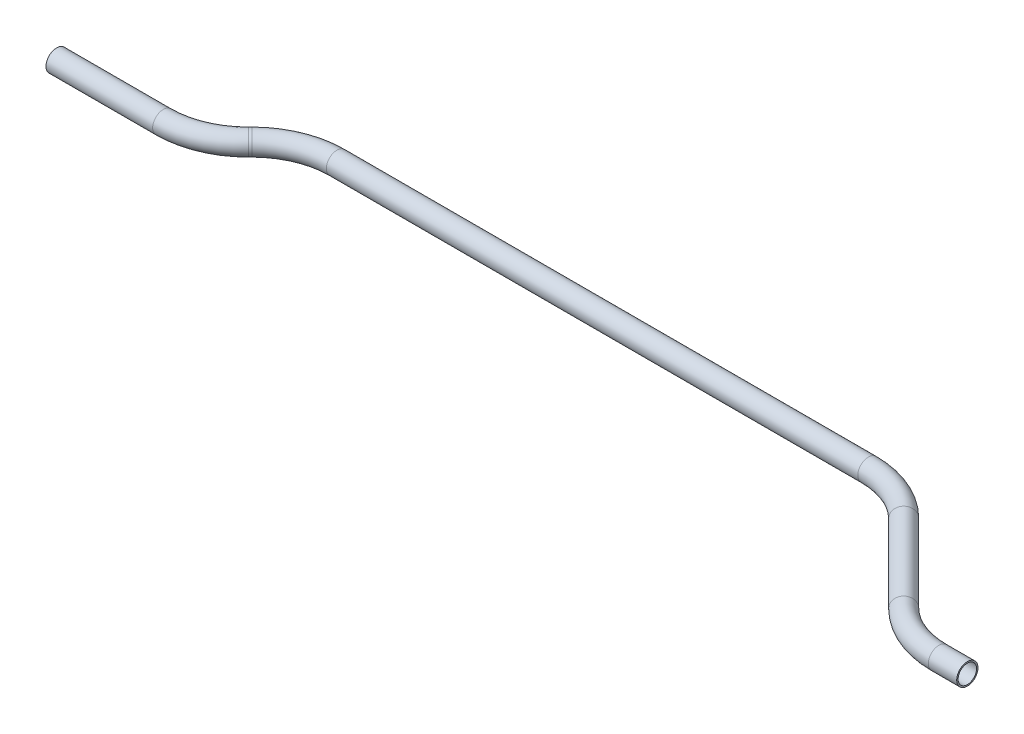
ISO-10303-21;
HEADER;
FILE_DESCRIPTION(('STEP AP214'),'2;1');
FILE_NAME('part.step','',(''),(''),'','','');
FILE_SCHEMA(('AUTOMOTIVE_DESIGN { 1 0 10303 214 1 1 1 1 }'));
ENDSEC;
DATA;
#1=APPLICATION_CONTEXT('core data for automotive mechanical design processes');
#2=APPLICATION_PROTOCOL_DEFINITION('international standard','automotive_design',2000,#1);
#3=PRODUCT_CONTEXT('',#1,'mechanical');
#4=PRODUCT('Part','Part','',(#3));
#5=PRODUCT_RELATED_PRODUCT_CATEGORY('part','',(#4));
#6=PRODUCT_DEFINITION_FORMATION('','',#4);
#7=PRODUCT_DEFINITION_CONTEXT('part definition',#1,'design');
#8=PRODUCT_DEFINITION('design','',#6,#7);
#9=PRODUCT_DEFINITION_SHAPE('','',#8);
#10=(LENGTH_UNIT() NAMED_UNIT(*) SI_UNIT(.MILLI.,.METRE.));
#11=(NAMED_UNIT(*) PLANE_ANGLE_UNIT() SI_UNIT($,.RADIAN.));
#12=(NAMED_UNIT(*) SI_UNIT($,.STERADIAN.) SOLID_ANGLE_UNIT());
#13=UNCERTAINTY_MEASURE_WITH_UNIT(LENGTH_MEASURE(1.E-05),#10,'distance_accuracy_value','');
#14=(GEOMETRIC_REPRESENTATION_CONTEXT(3) GLOBAL_UNCERTAINTY_ASSIGNED_CONTEXT((#13)) GLOBAL_UNIT_ASSIGNED_CONTEXT((#10,
#11,#12)) REPRESENTATION_CONTEXT('',''));
#15=CARTESIAN_POINT('',(0.,0.,0.));
#16=DIRECTION('',(0.,0.,1.));
#17=DIRECTION('',(1.,0.,0.));
#18=AXIS2_PLACEMENT_3D('',#15,#16,#17);
#19=CARTESIAN_POINT('',(0.,0.,0.));
#20=DIRECTION('',(1.,0.,0.));
#21=DIRECTION('',(0.,0.,-1.));
#22=AXIS2_PLACEMENT_3D('',#19,#20,#21);
#23=CYLINDRICAL_SURFACE('',#22,9.525);
#24=CARTESIAN_POINT('',(95.4369265471701,0.,0.));
#25=DIRECTION('',(1.,0.,0.));
#26=DIRECTION('',(0.,0.,-1.));
#27=AXIS2_PLACEMENT_3D('',#24,#25,#26);
#28=CIRCLE('',#27,9.525);
#29=CARTESIAN_POINT('',(95.4369265471701,0.,9.52499999999995));
#30=VERTEX_POINT('',#29);
#31=EDGE_CURVE('E59',#30,#30,#28,.T.);
#32=ORIENTED_EDGE('',*,*,#31,.F.);
#33=EDGE_LOOP('',(#32));
#34=FACE_BOUND('',#33,.T.);
#35=CARTESIAN_POINT('',(0.,0.,0.));
#36=DIRECTION('',(1.,0.,0.));
#37=DIRECTION('',(0.,0.,-1.));
#38=AXIS2_PLACEMENT_3D('',#35,#36,#37);
#39=CIRCLE('',#38,9.525);
#40=CARTESIAN_POINT('',(0.,0.,-9.525));
#41=VERTEX_POINT('',#40);
#42=EDGE_CURVE('E56',#41,#41,#39,.T.);
#43=ORIENTED_EDGE('',*,*,#42,.T.);
#44=EDGE_LOOP('',(#43));
#45=FACE_BOUND('',#44,.T.);
#46=ADVANCED_FACE('F35',(#34,#45),#23,.T.);
#47=CARTESIAN_POINT('',(95.4369265471701,0.,-76.2));
#48=DIRECTION('',(0.,1.,0.));
#49=DIRECTION('',(0.,0.,1.));
#50=AXIS2_PLACEMENT_3D('',#47,#48,#49);
#51=TOROIDAL_SURFACE('',#50,76.2,9.525);
#52=CARTESIAN_POINT('',(149.318463273585,0.,-22.3184632735852));
#53=DIRECTION('',(0.707106781186546,0.,-0.707106781186549));
#54=DIRECTION('',(-0.707106781186549,0.,-0.707106781186546));
#55=AXIS2_PLACEMENT_3D('',#52,#53,#54);
#56=CIRCLE('',#55,9.525);
#57=CARTESIAN_POINT('',(156.053655364387,0.,-15.5832711827834));
#58=VERTEX_POINT('',#57);
#59=EDGE_CURVE('E62',#58,#58,#56,.T.);
#60=CARTESIAN_POINT('',(95.4369265471701,0.,-76.2));
#61=DIRECTION('',(0.,1.,0.));
#62=DIRECTION('',(0.,0.,1.));
#63=AXIS2_PLACEMENT_3D('',#60,#61,#62);
#64=CIRCLE('',#63,85.725);
#65=EDGE_CURVE('',#30,#58,#64,.T.);
#66=ORIENTED_EDGE('',*,*,#31,.T.);
#67=ORIENTED_EDGE('',*,*,#59,.F.);
#68=ORIENTED_EDGE('',*,*,#65,.T.);
#69=ORIENTED_EDGE('',*,*,#65,.F.);
#70=EDGE_LOOP('',(#66,#68,#67,#69));
#71=FACE_BOUND('',#70,.T.);
#72=ADVANCED_FACE('F119',(#71),#51,.T.);
#73=CARTESIAN_POINT('',(149.318463273585,0.,-22.3184632735852));
#74=DIRECTION('',(0.707106781186572,0.,-0.707106781186523));
#75=DIRECTION('',(-0.707106781186523,0.,-0.707106781186572));
#76=AXIS2_PLACEMENT_3D('',#73,#74,#75);
#77=CYLINDRICAL_SURFACE('',#76,9.525);
#78=CARTESIAN_POINT('',(150.825395518015,0.,-23.8253955180148));
#79=DIRECTION('',(0.707106781186572,0.,-0.707106781186523));
#80=DIRECTION('',(-0.707106781186523,0.,-0.707106781186572));
#81=AXIS2_PLACEMENT_3D('',#78,#79,#80);
#82=CIRCLE('',#81,9.525);
#83=CARTESIAN_POINT('',(144.090203427213,0.,-30.5605876088167));
#84=VERTEX_POINT('',#83);
#85=EDGE_CURVE('E65',#84,#84,#82,.T.);
#86=ORIENTED_EDGE('',*,*,#85,.F.);
#87=EDGE_LOOP('',(#86));
#88=FACE_BOUND('',#87,.T.);
#89=ORIENTED_EDGE('',*,*,#59,.T.);
#90=EDGE_LOOP('',(#89));
#91=FACE_BOUND('',#90,.T.);
#92=ADVANCED_FACE('F123',(#88,#91),#77,.T.);
#93=CARTESIAN_POINT('',(204.70693224443,0.,30.0561412084));
#94=DIRECTION('',(0.,-1.,0.));
#95=DIRECTION('',(0.,0.,-1.));
#96=AXIS2_PLACEMENT_3D('',#93,#94,#95);
#97=TOROIDAL_SURFACE('',#96,76.2,9.525);
#98=CARTESIAN_POINT('',(204.70693224443,0.,-46.1438587916));
#99=DIRECTION('',(1.,0.,0.));
#100=DIRECTION('',(0.,0.,-1.));
#101=AXIS2_PLACEMENT_3D('',#98,#99,#100);
#102=CIRCLE('',#101,9.525);
#103=CARTESIAN_POINT('',(204.70693224443,0.,-55.6688587916));
#104=VERTEX_POINT('',#103);
#105=EDGE_CURVE('E68',#104,#104,#102,.T.);
#106=CARTESIAN_POINT('',(204.70693224443,0.,30.0561412084));
#107=DIRECTION('',(0.,-1.,0.));
#108=DIRECTION('',(0.,0.,-1.));
#109=AXIS2_PLACEMENT_3D('',#106,#107,#108);
#110=CIRCLE('',#109,85.725);
#111=EDGE_CURVE('',#84,#104,#110,.T.);
#112=ORIENTED_EDGE('',*,*,#85,.T.);
#113=ORIENTED_EDGE('',*,*,#105,.F.);
#114=ORIENTED_EDGE('',*,*,#111,.T.);
#115=ORIENTED_EDGE('',*,*,#111,.F.);
#116=EDGE_LOOP('',(#112,#114,#113,#115));
#117=FACE_BOUND('',#116,.T.);
#118=ADVANCED_FACE('F127',(#117),#97,.T.);
#119=CARTESIAN_POINT('',(204.70693224443,0.,-46.1438587916));
#120=DIRECTION('',(1.,0.,0.));
#121=DIRECTION('',(0.,0.,-1.));
#122=AXIS2_PLACEMENT_3D('',#119,#120,#121);
#123=CYLINDRICAL_SURFACE('',#122,9.525);
#124=CARTESIAN_POINT('',(680.25025188594,0.,-46.1438587916));
#125=DIRECTION('',(1.,0.,0.));
#126=DIRECTION('',(0.,0.,-1.));
#127=AXIS2_PLACEMENT_3D('',#124,#125,#126);
#128=CIRCLE('',#127,9.525);
#129=CARTESIAN_POINT('',(680.25025188594,0.,-55.6688587916));
#130=VERTEX_POINT('',#129);
#131=EDGE_CURVE('E71',#130,#130,#128,.T.);
#132=ORIENTED_EDGE('',*,*,#131,.F.);
#133=EDGE_LOOP('',(#132));
#134=FACE_BOUND('',#133,.T.);
#135=ORIENTED_EDGE('',*,*,#105,.T.);
#136=EDGE_LOOP('',(#135));
#137=FACE_BOUND('',#136,.T.);
#138=ADVANCED_FACE('F131',(#134,#137),#123,.T.);
#139=CARTESIAN_POINT('',(680.25025188594,0.,30.0561412084));
#140=DIRECTION('',(0.,-1.,0.));
#141=DIRECTION('',(0.,0.,-1.));
#142=AXIS2_PLACEMENT_3D('',#139,#140,#141);
#143=TOROIDAL_SURFACE('',#142,76.2,9.525);
#144=CARTESIAN_POINT('',(734.131788612355,0.,-23.8253955180148));
#145=DIRECTION('',(0.707106781186546,0.,0.707106781186549));
#146=DIRECTION('',(0.707106781186549,0.,-0.707106781186546));
#147=AXIS2_PLACEMENT_3D('',#144,#145,#146);
#148=CIRCLE('',#147,9.525);
#149=CARTESIAN_POINT('',(740.866980703157,0.,-30.5605876088167));
#150=VERTEX_POINT('',#149);
#151=EDGE_CURVE('E74',#150,#150,#148,.T.);
#152=CARTESIAN_POINT('',(680.25025188594,0.,30.0561412084));
#153=DIRECTION('',(0.,-1.,0.));
#154=DIRECTION('',(0.,0.,-1.));
#155=AXIS2_PLACEMENT_3D('',#152,#153,#154);
#156=CIRCLE('',#155,85.725);
#157=EDGE_CURVE('',#130,#150,#156,.T.);
#158=ORIENTED_EDGE('',*,*,#131,.T.);
#159=ORIENTED_EDGE('',*,*,#151,.F.);
#160=ORIENTED_EDGE('',*,*,#157,.T.);
#161=ORIENTED_EDGE('',*,*,#157,.F.);
#162=EDGE_LOOP('',(#158,#160,#159,#161));
#163=FACE_BOUND('',#162,.T.);
#164=ADVANCED_FACE('F93',(#163),#143,.T.);
#165=CARTESIAN_POINT('',(734.131788612355,0.,-23.8253955180148));
#166=DIRECTION('',(0.707106781186547,0.,0.707106781186549));
#167=DIRECTION('',(0.707106781186549,0.,-0.707106781186547));
#168=AXIS2_PLACEMENT_3D('',#165,#166,#167);
#169=CYLINDRICAL_SURFACE('',#168,9.525);
#170=CARTESIAN_POINT('',(803.794862065184,0.,45.8376779348149));
#171=DIRECTION('',(0.707106781186547,0.,0.707106781186549));
#172=DIRECTION('',(0.707106781186549,0.,-0.707106781186547));
#173=AXIS2_PLACEMENT_3D('',#170,#171,#172);
#174=CIRCLE('',#173,9.525);
#175=CARTESIAN_POINT('',(797.059669974383,0.,52.5728700256167));
#176=VERTEX_POINT('',#175);
#177=EDGE_CURVE('E76',#176,#176,#174,.T.);
#178=ORIENTED_EDGE('',*,*,#177,.F.);
#179=EDGE_LOOP('',(#178));
#180=FACE_BOUND('',#179,.T.);
#181=ORIENTED_EDGE('',*,*,#151,.T.);
#182=EDGE_LOOP('',(#181));
#183=FACE_BOUND('',#182,.T.);
#184=ADVANCED_FACE('F86',(#180,#183),#169,.T.);
#185=CARTESIAN_POINT('',(857.676398791599,0.,-8.04385879160001));
#186=DIRECTION('',(0.,1.,0.));
#187=DIRECTION('',(0.,0.,1.));
#188=AXIS2_PLACEMENT_3D('',#185,#186,#187);
#189=TOROIDAL_SURFACE('',#188,76.2,9.525);
#190=CARTESIAN_POINT('',(857.676398791599,0.,68.1561412084));
#191=DIRECTION('',(1.,0.,0.));
#192=DIRECTION('',(0.,0.,-1.));
#193=AXIS2_PLACEMENT_3D('',#190,#191,#192);
#194=CIRCLE('',#193,9.525);
#195=CARTESIAN_POINT('',(857.676398791599,0.,77.6811412084));
#196=VERTEX_POINT('',#195);
#197=EDGE_CURVE('E39',#196,#196,#194,.T.);
#198=CARTESIAN_POINT('',(857.676398791599,0.,-8.04385879160001));
#199=DIRECTION('',(0.,1.,0.));
#200=DIRECTION('',(0.,0.,1.));
#201=AXIS2_PLACEMENT_3D('',#198,#199,#200);
#202=CIRCLE('',#201,85.725);
#203=EDGE_CURVE('',#176,#196,#202,.T.);
#204=ORIENTED_EDGE('',*,*,#177,.T.);
#205=ORIENTED_EDGE('',*,*,#197,.F.);
#206=ORIENTED_EDGE('',*,*,#203,.T.);
#207=ORIENTED_EDGE('',*,*,#203,.F.);
#208=EDGE_LOOP('',(#204,#206,#205,#207));
#209=FACE_BOUND('',#208,.T.);
#210=ADVANCED_FACE('F84',(#209),#189,.T.);
#211=CARTESIAN_POINT('',(857.676398791599,0.,68.1561412084));
#212=DIRECTION('',(1.,0.,0.));
#213=DIRECTION('',(0.,0.,-1.));
#214=AXIS2_PLACEMENT_3D('',#211,#212,#213);
#215=CYLINDRICAL_SURFACE('',#214,9.525);
#216=CARTESIAN_POINT('',(883.076398791599,0.,68.1561412084));
#217=DIRECTION('',(1.,0.,0.));
#218=DIRECTION('',(0.,0.,-1.));
#219=AXIS2_PLACEMENT_3D('',#216,#217,#218);
#220=CIRCLE('',#219,9.525);
#221=CARTESIAN_POINT('',(883.076398791599,0.,58.6311412084));
#222=VERTEX_POINT('',#221);
#223=EDGE_CURVE('E52',#222,#222,#220,.T.);
#224=ORIENTED_EDGE('',*,*,#223,.F.);
#225=EDGE_LOOP('',(#224));
#226=FACE_BOUND('',#225,.T.);
#227=ORIENTED_EDGE('',*,*,#197,.T.);
#228=EDGE_LOOP('',(#227));
#229=FACE_BOUND('',#228,.T.);
#230=ADVANCED_FACE('F37',(#226,#229),#215,.T.);
#231=CARTESIAN_POINT('',(0.,0.,0.));
#232=DIRECTION('',(1.,0.,0.));
#233=DIRECTION('',(0.,0.,-1.));
#234=AXIS2_PLACEMENT_3D('',#231,#232,#233);
#235=PLANE('',#234);
#236=CARTESIAN_POINT('',(0.,0.,0.));
#237=DIRECTION('',(1.,0.,0.));
#238=DIRECTION('',(0.,0.,-1.));
#239=AXIS2_PLACEMENT_3D('',#236,#237,#238);
#240=CIRCLE('',#239,8.2804);
#241=CARTESIAN_POINT('',(0.,0.,-8.2804));
#242=VERTEX_POINT('',#241);
#243=EDGE_CURVE('E55',#242,#242,#240,.F.);
#244=ORIENTED_EDGE('',*,*,#243,.F.);
#245=EDGE_LOOP('',(#244));
#246=FACE_BOUND('',#245,.T.);
#247=ORIENTED_EDGE('',*,*,#42,.F.);
#248=EDGE_LOOP('',(#247));
#249=FACE_BOUND('',#248,.T.);
#250=ADVANCED_FACE('F91',(#246,#249),#235,.F.);
#251=CARTESIAN_POINT('',(883.076398791599,0.,68.1561412084));
#252=DIRECTION('',(1.,0.,0.));
#253=DIRECTION('',(0.,0.,-1.));
#254=AXIS2_PLACEMENT_3D('',#251,#252,#253);
#255=PLANE('',#254);
#256=CARTESIAN_POINT('',(883.076398791599,0.,68.1561412084));
#257=DIRECTION('',(1.,0.,0.));
#258=DIRECTION('',(0.,0.,-1.));
#259=AXIS2_PLACEMENT_3D('',#256,#257,#258);
#260=CIRCLE('',#259,8.2804);
#261=CARTESIAN_POINT('',(883.076398791599,0.,59.8757412084));
#262=VERTEX_POINT('',#261);
#263=EDGE_CURVE('E10',#262,#262,#260,.F.);
#264=ORIENTED_EDGE('',*,*,#263,.T.);
#265=EDGE_LOOP('',(#264));
#266=FACE_BOUND('',#265,.T.);
#267=ORIENTED_EDGE('',*,*,#223,.T.);
#268=EDGE_LOOP('',(#267));
#269=FACE_BOUND('',#268,.T.);
#270=ADVANCED_FACE('F110',(#266,#269),#255,.T.);
#271=CARTESIAN_POINT('',(0.,0.,0.));
#272=DIRECTION('',(1.,0.,0.));
#273=DIRECTION('',(0.,0.,-1.));
#274=AXIS2_PLACEMENT_3D('',#271,#272,#273);
#275=CYLINDRICAL_SURFACE('',#274,8.2804);
#276=CARTESIAN_POINT('',(95.4369265471701,0.,0.));
#277=DIRECTION('',(1.,0.,0.));
#278=DIRECTION('',(0.,0.,-1.));
#279=AXIS2_PLACEMENT_3D('',#276,#277,#278);
#280=CIRCLE('',#279,8.2804);
#281=CARTESIAN_POINT('',(95.4369265471701,0.,8.28039999999994));
#282=VERTEX_POINT('',#281);
#283=EDGE_CURVE('E284',#282,#282,#280,.F.);
#284=ORIENTED_EDGE('',*,*,#283,.F.);
#285=EDGE_LOOP('',(#284));
#286=FACE_BOUND('',#285,.T.);
#287=ORIENTED_EDGE('',*,*,#243,.T.);
#288=EDGE_LOOP('',(#287));
#289=FACE_BOUND('',#288,.T.);
#290=ADVANCED_FACE('F113',(#286,#289),#275,.F.);
#291=CARTESIAN_POINT('',(95.4369265471701,0.,-76.2));
#292=DIRECTION('',(0.,1.,0.));
#293=DIRECTION('',(0.,0.,1.));
#294=AXIS2_PLACEMENT_3D('',#291,#292,#293);
#295=TOROIDAL_SURFACE('',#294,76.2,8.2804);
#296=CARTESIAN_POINT('',(149.318463273585,0.,-22.3184632735852));
#297=DIRECTION('',(0.707106781186546,0.,-0.707106781186549));
#298=DIRECTION('',(-0.707106781186549,0.,-0.707106781186546));
#299=AXIS2_PLACEMENT_3D('',#296,#297,#298);
#300=CIRCLE('',#299,8.2804);
#301=CARTESIAN_POINT('',(155.173590264522,0.,-16.4633362826481));
#302=VERTEX_POINT('',#301);
#303=EDGE_CURVE('E281',#302,#302,#300,.F.);
#304=CARTESIAN_POINT('',(95.4369265471701,0.,-76.2));
#305=DIRECTION('',(0.,1.,0.));
#306=DIRECTION('',(0.,0.,1.));
#307=AXIS2_PLACEMENT_3D('',#304,#305,#306);
#308=CIRCLE('',#307,84.4804);
#309=EDGE_CURVE('',#282,#302,#308,.T.);
#310=ORIENTED_EDGE('',*,*,#283,.T.);
#311=ORIENTED_EDGE('',*,*,#303,.F.);
#312=ORIENTED_EDGE('',*,*,#309,.T.);
#313=ORIENTED_EDGE('',*,*,#309,.F.);
#314=EDGE_LOOP('',(#310,#312,#311,#313));
#315=FACE_BOUND('',#314,.T.);
#316=ADVANCED_FACE('F192',(#315),#295,.F.);
#317=CARTESIAN_POINT('',(149.318463273585,0.,-22.3184632735852));
#318=DIRECTION('',(0.707106781186572,0.,-0.707106781186523));
#319=DIRECTION('',(-0.707106781186523,0.,-0.707106781186572));
#320=AXIS2_PLACEMENT_3D('',#317,#318,#319);
#321=CYLINDRICAL_SURFACE('',#320,8.2804);
#322=CARTESIAN_POINT('',(150.825395518015,0.,-23.8253955180148));
#323=DIRECTION('',(0.707106781186572,0.,-0.707106781186523));
#324=DIRECTION('',(-0.707106781186523,0.,-0.707106781186572));
#325=AXIS2_PLACEMENT_3D('',#322,#323,#324);
#326=CIRCLE('',#325,8.2804);
#327=CARTESIAN_POINT('',(144.970268527078,0.,-29.6805225089519));
#328=VERTEX_POINT('',#327);
#329=EDGE_CURVE('E278',#328,#328,#326,.F.);
#330=ORIENTED_EDGE('',*,*,#329,.F.);
#331=EDGE_LOOP('',(#330));
#332=FACE_BOUND('',#331,.T.);
#333=ORIENTED_EDGE('',*,*,#303,.T.);
#334=EDGE_LOOP('',(#333));
#335=FACE_BOUND('',#334,.T.);
#336=ADVANCED_FACE('F202',(#332,#335),#321,.F.);
#337=CARTESIAN_POINT('',(204.70693224443,0.,30.0561412084));
#338=DIRECTION('',(0.,-1.,0.));
#339=DIRECTION('',(0.,0.,-1.));
#340=AXIS2_PLACEMENT_3D('',#337,#338,#339);
#341=TOROIDAL_SURFACE('',#340,76.2,8.2804);
#342=CARTESIAN_POINT('',(204.70693224443,0.,-46.1438587916));
#343=DIRECTION('',(1.,0.,0.));
#344=DIRECTION('',(0.,0.,-1.));
#345=AXIS2_PLACEMENT_3D('',#342,#343,#344);
#346=CIRCLE('',#345,8.2804);
#347=CARTESIAN_POINT('',(204.70693224443,0.,-54.4242587916));
#348=VERTEX_POINT('',#347);
#349=EDGE_CURVE('E273',#348,#348,#346,.F.);
#350=CARTESIAN_POINT('',(204.70693224443,0.,30.0561412084));
#351=DIRECTION('',(0.,-1.,0.));
#352=DIRECTION('',(0.,0.,-1.));
#353=AXIS2_PLACEMENT_3D('',#350,#351,#352);
#354=CIRCLE('',#353,84.4804);
#355=EDGE_CURVE('',#328,#348,#354,.T.);
#356=ORIENTED_EDGE('',*,*,#329,.T.);
#357=ORIENTED_EDGE('',*,*,#349,.F.);
#358=ORIENTED_EDGE('',*,*,#355,.T.);
#359=ORIENTED_EDGE('',*,*,#355,.F.);
#360=EDGE_LOOP('',(#356,#358,#357,#359));
#361=FACE_BOUND('',#360,.T.);
#362=ADVANCED_FACE('F212',(#361),#341,.F.);
#363=CARTESIAN_POINT('',(204.70693224443,0.,-46.1438587916));
#364=DIRECTION('',(1.,0.,0.));
#365=DIRECTION('',(0.,0.,-1.));
#366=AXIS2_PLACEMENT_3D('',#363,#364,#365);
#367=CYLINDRICAL_SURFACE('',#366,8.2804);
#368=CARTESIAN_POINT('',(680.25025188594,0.,-46.1438587916));
#369=DIRECTION('',(1.,0.,0.));
#370=DIRECTION('',(0.,0.,-1.));
#371=AXIS2_PLACEMENT_3D('',#368,#369,#370);
#372=CIRCLE('',#371,8.2804);
#373=CARTESIAN_POINT('',(680.25025188594,0.,-54.4242587916));
#374=VERTEX_POINT('',#373);
#375=EDGE_CURVE('E270',#374,#374,#372,.F.);
#376=ORIENTED_EDGE('',*,*,#375,.F.);
#377=EDGE_LOOP('',(#376));
#378=FACE_BOUND('',#377,.T.);
#379=ORIENTED_EDGE('',*,*,#349,.T.);
#380=EDGE_LOOP('',(#379));
#381=FACE_BOUND('',#380,.T.);
#382=ADVANCED_FACE('F222',(#378,#381),#367,.F.);
#383=CARTESIAN_POINT('',(680.25025188594,0.,30.0561412084));
#384=DIRECTION('',(0.,-1.,0.));
#385=DIRECTION('',(0.,0.,-1.));
#386=AXIS2_PLACEMENT_3D('',#383,#384,#385);
#387=TOROIDAL_SURFACE('',#386,76.2,8.2804);
#388=CARTESIAN_POINT('',(734.131788612355,0.,-23.8253955180148));
#389=DIRECTION('',(0.707106781186546,0.,0.707106781186549));
#390=DIRECTION('',(0.707106781186549,0.,-0.707106781186546));
#391=AXIS2_PLACEMENT_3D('',#388,#389,#390);
#392=CIRCLE('',#391,8.2804);
#393=CARTESIAN_POINT('',(739.986915603292,0.,-29.6805225089519));
#394=VERTEX_POINT('',#393);
#395=EDGE_CURVE('E269',#394,#394,#392,.F.);
#396=CARTESIAN_POINT('',(680.25025188594,0.,30.0561412084));
#397=DIRECTION('',(0.,-1.,0.));
#398=DIRECTION('',(0.,0.,-1.));
#399=AXIS2_PLACEMENT_3D('',#396,#397,#398);
#400=CIRCLE('',#399,84.4804);
#401=EDGE_CURVE('',#374,#394,#400,.T.);
#402=ORIENTED_EDGE('',*,*,#375,.T.);
#403=ORIENTED_EDGE('',*,*,#395,.F.);
#404=ORIENTED_EDGE('',*,*,#401,.T.);
#405=ORIENTED_EDGE('',*,*,#401,.F.);
#406=EDGE_LOOP('',(#402,#404,#403,#405));
#407=FACE_BOUND('',#406,.T.);
#408=ADVANCED_FACE('F232',(#407),#387,.F.);
#409=CARTESIAN_POINT('',(734.131788612355,0.,-23.8253955180148));
#410=DIRECTION('',(0.707106781186547,0.,0.707106781186549));
#411=DIRECTION('',(0.707106781186549,0.,-0.707106781186547));
#412=AXIS2_PLACEMENT_3D('',#409,#410,#411);
#413=CYLINDRICAL_SURFACE('',#412,8.2804);
#414=CARTESIAN_POINT('',(803.794862065184,0.,45.8376779348149));
#415=DIRECTION('',(0.707106781186547,0.,0.707106781186549));
#416=DIRECTION('',(0.707106781186549,0.,-0.707106781186547));
#417=AXIS2_PLACEMENT_3D('',#414,#415,#416);
#418=CIRCLE('',#417,8.2804);
#419=CARTESIAN_POINT('',(797.939735074247,0.,51.692804925752));
#420=VERTEX_POINT('',#419);
#421=EDGE_CURVE('E48',#420,#420,#418,.F.);
#422=ORIENTED_EDGE('',*,*,#421,.F.);
#423=EDGE_LOOP('',(#422));
#424=FACE_BOUND('',#423,.T.);
#425=ORIENTED_EDGE('',*,*,#395,.T.);
#426=EDGE_LOOP('',(#425));
#427=FACE_BOUND('',#426,.T.);
#428=ADVANCED_FACE('F104',(#424,#427),#413,.F.);
#429=CARTESIAN_POINT('',(857.676398791599,0.,-8.04385879160001));
#430=DIRECTION('',(0.,1.,0.));
#431=DIRECTION('',(0.,0.,1.));
#432=AXIS2_PLACEMENT_3D('',#429,#430,#431);
#433=TOROIDAL_SURFACE('',#432,76.2,8.2804);
#434=CARTESIAN_POINT('',(857.676398791599,0.,68.1561412084));
#435=DIRECTION('',(1.,0.,0.));
#436=DIRECTION('',(0.,0.,-1.));
#437=AXIS2_PLACEMENT_3D('',#434,#435,#436);
#438=CIRCLE('',#437,8.2804);
#439=CARTESIAN_POINT('',(857.676398791599,0.,76.4365412084));
#440=VERTEX_POINT('',#439);
#441=EDGE_CURVE('E43',#440,#440,#438,.F.);
#442=CARTESIAN_POINT('',(857.676398791599,0.,-8.04385879160001));
#443=DIRECTION('',(0.,1.,0.));
#444=DIRECTION('',(0.,0.,1.));
#445=AXIS2_PLACEMENT_3D('',#442,#443,#444);
#446=CIRCLE('',#445,84.4804);
#447=EDGE_CURVE('',#420,#440,#446,.T.);
#448=ORIENTED_EDGE('',*,*,#421,.T.);
#449=ORIENTED_EDGE('',*,*,#441,.F.);
#450=ORIENTED_EDGE('',*,*,#447,.T.);
#451=ORIENTED_EDGE('',*,*,#447,.F.);
#452=EDGE_LOOP('',(#448,#450,#449,#451));
#453=FACE_BOUND('',#452,.T.);
#454=ADVANCED_FACE('F98',(#453),#433,.F.);
#455=CARTESIAN_POINT('',(857.676398791599,0.,68.1561412084));
#456=DIRECTION('',(1.,0.,0.));
#457=DIRECTION('',(0.,0.,-1.));
#458=AXIS2_PLACEMENT_3D('',#455,#456,#457);
#459=CYLINDRICAL_SURFACE('',#458,8.2804);
#460=ORIENTED_EDGE('',*,*,#263,.F.);
#461=EDGE_LOOP('',(#460));
#462=FACE_BOUND('',#461,.T.);
#463=ORIENTED_EDGE('',*,*,#441,.T.);
#464=EDGE_LOOP('',(#463));
#465=FACE_BOUND('',#464,.T.);
#466=ADVANCED_FACE('F96',(#462,#465),#459,.F.);
#467=CLOSED_SHELL('',(#46,#72,#92,#118,#138,#164,#184,#210,#230,#250,#270,#290,#316,#336,#362,
#382,#408,#428,#454,#466));
#468=MANIFOLD_SOLID_BREP('B2',#467);
#469=ADVANCED_BREP_SHAPE_REPRESENTATION('',(#18,#468),#14);
#470=SHAPE_DEFINITION_REPRESENTATION(#9,#469);
ENDSEC;
END-ISO-10303-21;
